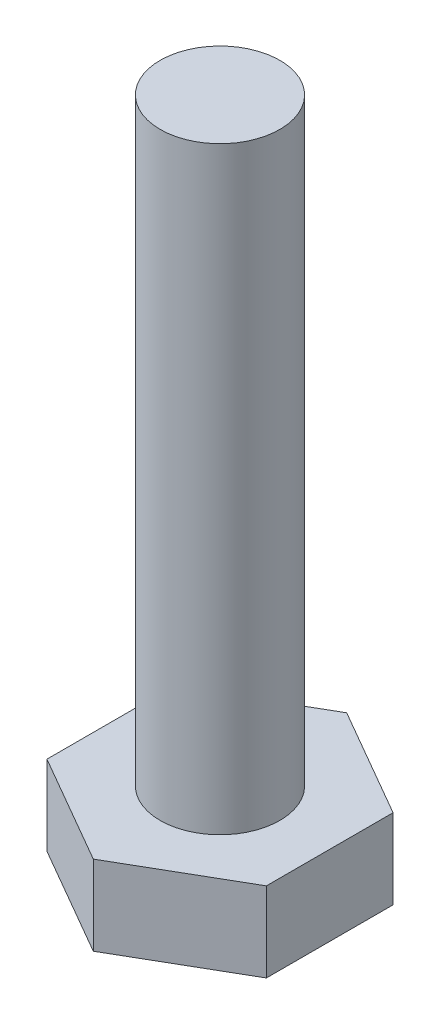
ISO-10303-21;
HEADER;
FILE_DESCRIPTION(('STEP AP214'),'2;1');
FILE_NAME('part.step','',(''),(''),'','','');
FILE_SCHEMA(('AUTOMOTIVE_DESIGN { 1 0 10303 214 1 1 1 1 }'));
ENDSEC;
DATA;
#1=APPLICATION_CONTEXT('core data for automotive mechanical design processes');
#2=APPLICATION_PROTOCOL_DEFINITION('international standard','automotive_design',2000,#1);
#3=PRODUCT_CONTEXT('',#1,'mechanical');
#4=PRODUCT('Part','Part','',(#3));
#5=PRODUCT_RELATED_PRODUCT_CATEGORY('part','',(#4));
#6=PRODUCT_DEFINITION_FORMATION('','',#4);
#7=PRODUCT_DEFINITION_CONTEXT('part definition',#1,'design');
#8=PRODUCT_DEFINITION('design','',#6,#7);
#9=PRODUCT_DEFINITION_SHAPE('','',#8);
#10=(LENGTH_UNIT() NAMED_UNIT(*) SI_UNIT(.MILLI.,.METRE.));
#11=(NAMED_UNIT(*) PLANE_ANGLE_UNIT() SI_UNIT($,.RADIAN.));
#12=(NAMED_UNIT(*) SI_UNIT($,.STERADIAN.) SOLID_ANGLE_UNIT());
#13=UNCERTAINTY_MEASURE_WITH_UNIT(LENGTH_MEASURE(1.E-05),#10,'distance_accuracy_value','');
#14=(GEOMETRIC_REPRESENTATION_CONTEXT(3) GLOBAL_UNCERTAINTY_ASSIGNED_CONTEXT((#13)) GLOBAL_UNIT_ASSIGNED_CONTEXT((#10,
#11,#12)) REPRESENTATION_CONTEXT('',''));
#15=CARTESIAN_POINT('',(0.,0.,0.));
#16=DIRECTION('',(0.,0.,1.));
#17=DIRECTION('',(1.,0.,0.));
#18=AXIS2_PLACEMENT_3D('',#15,#16,#17);
#19=CARTESIAN_POINT('',(2.74999999999998,2.,-1.5877132402715));
#20=DIRECTION('',(-0.499999999999995,0.,0.866025403784442));
#21=DIRECTION('',(0.866025403784442,0.,0.499999999999995));
#22=AXIS2_PLACEMENT_3D('',#19,#20,#21);
#23=PLANE('',#22);
#24=DIRECTION('',(-0.866025403784442,0.,-0.499999999999995));
#25=VECTOR('',#24,1.);
#26=CARTESIAN_POINT('',(2.74999999999998,0.,-1.5877132402715));
#27=LINE('',#26,#25);
#28=CARTESIAN_POINT('',(2.74999999999998,0.,-1.5877132402715));
#29=VERTEX_POINT('',#28);
#30=CARTESIAN_POINT('',(0.,0.,-3.17542648054294));
#31=VERTEX_POINT('',#30);
#32=EDGE_CURVE('E118',#29,#31,#27,.T.);
#33=ORIENTED_EDGE('',*,*,#32,.T.);
#34=DIRECTION('',(0.,-1.,0.));
#35=VECTOR('',#34,1.);
#36=CARTESIAN_POINT('',(0.,2.,-3.17542648054294));
#37=LINE('',#36,#35);
#38=CARTESIAN_POINT('',(0.,2.,-3.17542648054294));
#39=VERTEX_POINT('',#38);
#40=EDGE_CURVE('E11',#39,#31,#37,.T.);
#41=ORIENTED_EDGE('',*,*,#40,.F.);
#42=DIRECTION('',(-0.866025403784442,0.,-0.499999999999995));
#43=VECTOR('',#42,1.);
#44=CARTESIAN_POINT('',(2.74999999999998,2.,-1.5877132402715));
#45=LINE('',#44,#43);
#46=CARTESIAN_POINT('',(2.74999999999998,2.,-1.5877132402715));
#47=VERTEX_POINT('',#46);
#48=EDGE_CURVE('E129',#47,#39,#45,.T.);
#49=ORIENTED_EDGE('',*,*,#48,.F.);
#50=DIRECTION('',(0.,-1.,0.));
#51=VECTOR('',#50,1.);
#52=CARTESIAN_POINT('',(2.74999999999998,2.,-1.5877132402715));
#53=LINE('',#52,#51);
#54=EDGE_CURVE('E114',#47,#29,#53,.T.);
#55=ORIENTED_EDGE('',*,*,#54,.T.);
#56=EDGE_LOOP('',(#33,#41,#49,#55));
#57=FACE_BOUND('',#56,.T.);
#58=ADVANCED_FACE('F34',(#57),#23,.F.);
#59=CARTESIAN_POINT('',(0.,2.,-3.17542648054294));
#60=DIRECTION('',(0.500000000000001,0.,0.866025403784438));
#61=DIRECTION('',(0.866025403784438,0.,-0.500000000000001));
#62=AXIS2_PLACEMENT_3D('',#59,#60,#61);
#63=PLANE('',#62);
#64=DIRECTION('',(-0.866025403784438,0.,0.500000000000001));
#65=VECTOR('',#64,1.);
#66=CARTESIAN_POINT('',(0.,0.,-3.17542648054294));
#67=LINE('',#66,#65);
#68=CARTESIAN_POINT('',(-2.75000000000001,0.,-1.58771324027147));
#69=VERTEX_POINT('',#68);
#70=EDGE_CURVE('E121',#31,#69,#67,.T.);
#71=ORIENTED_EDGE('',*,*,#70,.T.);
#72=DIRECTION('',(0.,-1.,0.));
#73=VECTOR('',#72,1.);
#74=CARTESIAN_POINT('',(-2.75000000000001,2.,-1.58771324027147));
#75=LINE('',#74,#73);
#76=CARTESIAN_POINT('',(-2.75000000000001,2.,-1.58771324027147));
#77=VERTEX_POINT('',#76);
#78=EDGE_CURVE('E42',#77,#69,#75,.T.);
#79=ORIENTED_EDGE('',*,*,#78,.F.);
#80=DIRECTION('',(-0.866025403784438,0.,0.500000000000001));
#81=VECTOR('',#80,1.);
#82=CARTESIAN_POINT('',(0.,2.,-3.17542648054294));
#83=LINE('',#82,#81);
#84=EDGE_CURVE('E87',#39,#77,#83,.T.);
#85=ORIENTED_EDGE('',*,*,#84,.F.);
#86=ORIENTED_EDGE('',*,*,#40,.T.);
#87=EDGE_LOOP('',(#71,#79,#85,#86));
#88=FACE_BOUND('',#87,.T.);
#89=ADVANCED_FACE('F154',(#88),#63,.F.);
#90=CARTESIAN_POINT('',(-2.75000000000001,2.,-1.58771324027147));
#91=DIRECTION('',(1.,0.,0.));
#92=DIRECTION('',(0.,0.,-1.));
#93=AXIS2_PLACEMENT_3D('',#90,#91,#92);
#94=PLANE('',#93);
#95=DIRECTION('',(0.,0.,1.));
#96=VECTOR('',#95,1.);
#97=CARTESIAN_POINT('',(-2.75000000000001,0.,-1.58771324027147));
#98=LINE('',#97,#96);
#99=CARTESIAN_POINT('',(-2.74999999999999,0.,1.58771324027148));
#100=VERTEX_POINT('',#99);
#101=EDGE_CURVE('E124',#69,#100,#98,.T.);
#102=ORIENTED_EDGE('',*,*,#101,.T.);
#103=DIRECTION('',(0.,-1.,0.));
#104=VECTOR('',#103,1.);
#105=CARTESIAN_POINT('',(-2.74999999999999,2.,1.58771324027148));
#106=LINE('',#105,#104);
#107=CARTESIAN_POINT('',(-2.74999999999999,2.,1.58771324027148));
#108=VERTEX_POINT('',#107);
#109=EDGE_CURVE('E109',#108,#100,#106,.T.);
#110=ORIENTED_EDGE('',*,*,#109,.F.);
#111=DIRECTION('',(0.,0.,1.));
#112=VECTOR('',#111,1.);
#113=CARTESIAN_POINT('',(-2.75000000000001,2.,-1.58771324027147));
#114=LINE('',#113,#112);
#115=EDGE_CURVE('E100',#77,#108,#114,.T.);
#116=ORIENTED_EDGE('',*,*,#115,.F.);
#117=ORIENTED_EDGE('',*,*,#78,.T.);
#118=EDGE_LOOP('',(#102,#110,#116,#117));
#119=FACE_BOUND('',#118,.T.);
#120=ADVANCED_FACE('F135',(#119),#94,.F.);
#121=CARTESIAN_POINT('',(-2.74999999999999,2.,1.58771324027148));
#122=DIRECTION('',(0.499999999999995,0.,-0.866025403784441));
#123=DIRECTION('',(-0.866025403784442,0.,-0.499999999999995));
#124=AXIS2_PLACEMENT_3D('',#121,#122,#123);
#125=PLANE('',#124);
#126=DIRECTION('',(0.866025403784441,0.,0.499999999999995));
#127=VECTOR('',#126,1.);
#128=CARTESIAN_POINT('',(-2.74999999999999,0.,1.58771324027148));
#129=LINE('',#128,#127);
#130=CARTESIAN_POINT('',(0.,0.,3.17542648054294));
#131=VERTEX_POINT('',#130);
#132=EDGE_CURVE('E108',#100,#131,#129,.T.);
#133=ORIENTED_EDGE('',*,*,#132,.T.);
#134=DIRECTION('',(0.,-1.,0.));
#135=VECTOR('',#134,1.);
#136=CARTESIAN_POINT('',(0.,2.,3.17542648054294));
#137=LINE('',#136,#135);
#138=CARTESIAN_POINT('',(0.,2.,3.17542648054294));
#139=VERTEX_POINT('',#138);
#140=EDGE_CURVE('E105',#139,#131,#137,.T.);
#141=ORIENTED_EDGE('',*,*,#140,.F.);
#142=DIRECTION('',(0.866025403784441,0.,0.499999999999995));
#143=VECTOR('',#142,1.);
#144=CARTESIAN_POINT('',(-2.74999999999999,2.,1.58771324027148));
#145=LINE('',#144,#143);
#146=EDGE_CURVE('E94',#108,#139,#145,.T.);
#147=ORIENTED_EDGE('',*,*,#146,.F.);
#148=ORIENTED_EDGE('',*,*,#109,.T.);
#149=EDGE_LOOP('',(#133,#141,#147,#148));
#150=FACE_BOUND('',#149,.T.);
#151=ADVANCED_FACE('F106',(#150),#125,.F.);
#152=CARTESIAN_POINT('',(0.,2.,3.17542648054294));
#153=DIRECTION('',(-0.500000000000007,0.,-0.866025403784435));
#154=DIRECTION('',(-0.866025403784435,0.,0.500000000000007));
#155=AXIS2_PLACEMENT_3D('',#152,#153,#154);
#156=PLANE('',#155);
#157=DIRECTION('',(0.866025403784435,0.,-0.500000000000007));
#158=VECTOR('',#157,1.);
#159=CARTESIAN_POINT('',(0.,0.,3.17542648054294));
#160=LINE('',#159,#158);
#161=CARTESIAN_POINT('',(2.75000000000002,0.,1.58771324027145));
#162=VERTEX_POINT('',#161);
#163=EDGE_CURVE('E73',#131,#162,#160,.T.);
#164=ORIENTED_EDGE('',*,*,#163,.T.);
#165=DIRECTION('',(0.,-1.,0.));
#166=VECTOR('',#165,1.);
#167=CARTESIAN_POINT('',(2.75000000000002,2.,1.58771324027145));
#168=LINE('',#167,#166);
#169=CARTESIAN_POINT('',(2.75000000000002,2.,1.58771324027145));
#170=VERTEX_POINT('',#169);
#171=EDGE_CURVE('E110',#170,#162,#168,.T.);
#172=ORIENTED_EDGE('',*,*,#171,.F.);
#173=DIRECTION('',(0.866025403784435,0.,-0.500000000000007));
#174=VECTOR('',#173,1.);
#175=CARTESIAN_POINT('',(0.,2.,3.17542648054294));
#176=LINE('',#175,#174);
#177=EDGE_CURVE('E98',#139,#170,#176,.T.);
#178=ORIENTED_EDGE('',*,*,#177,.F.);
#179=ORIENTED_EDGE('',*,*,#140,.T.);
#180=EDGE_LOOP('',(#164,#172,#178,#179));
#181=FACE_BOUND('',#180,.T.);
#182=ADVANCED_FACE('F112',(#181),#156,.F.);
#183=CARTESIAN_POINT('',(2.75000000000002,2.,1.58771324027145));
#184=DIRECTION('',(-1.,0.,0.));
#185=DIRECTION('',(0.,0.,1.));
#186=AXIS2_PLACEMENT_3D('',#183,#184,#185);
#187=PLANE('',#186);
#188=DIRECTION('',(0.,0.,-1.));
#189=VECTOR('',#188,1.);
#190=CARTESIAN_POINT('',(2.75000000000002,0.,1.58771324027145));
#191=LINE('',#190,#189);
#192=EDGE_CURVE('E79',#162,#29,#191,.T.);
#193=ORIENTED_EDGE('',*,*,#192,.T.);
#194=ORIENTED_EDGE('',*,*,#54,.F.);
#195=DIRECTION('',(0.,0.,-1.));
#196=VECTOR('',#195,1.);
#197=CARTESIAN_POINT('',(2.75000000000002,2.,1.58771324027145));
#198=LINE('',#197,#196);
#199=EDGE_CURVE('E50',#170,#47,#198,.T.);
#200=ORIENTED_EDGE('',*,*,#199,.F.);
#201=ORIENTED_EDGE('',*,*,#171,.T.);
#202=EDGE_LOOP('',(#193,#194,#200,#201));
#203=FACE_BOUND('',#202,.T.);
#204=ADVANCED_FACE('F142',(#203),#187,.F.);
#205=CARTESIAN_POINT('',(0.,2.,0.));
#206=DIRECTION('',(0.,1.,0.));
#207=DIRECTION('',(0.,0.,1.));
#208=AXIS2_PLACEMENT_3D('',#205,#206,#207);
#209=PLANE('',#208);
#210=CARTESIAN_POINT('',(0.,2.,0.));
#211=DIRECTION('',(0.,1.,0.));
#212=DIRECTION('',(0.,0.,1.));
#213=AXIS2_PLACEMENT_3D('',#210,#211,#212);
#214=CIRCLE('',#213,1.5);
#215=CARTESIAN_POINT('',(0.,2.,1.5));
#216=VERTEX_POINT('',#215);
#217=EDGE_CURVE('E215',#216,#216,#214,.T.);
#218=ORIENTED_EDGE('',*,*,#217,.F.);
#219=EDGE_LOOP('',(#218));
#220=FACE_BOUND('',#219,.T.);
#221=ORIENTED_EDGE('',*,*,#48,.T.);
#222=ORIENTED_EDGE('',*,*,#84,.T.);
#223=ORIENTED_EDGE('',*,*,#115,.T.);
#224=ORIENTED_EDGE('',*,*,#146,.T.);
#225=ORIENTED_EDGE('',*,*,#177,.T.);
#226=ORIENTED_EDGE('',*,*,#199,.T.);
#227=EDGE_LOOP('',(#221,#222,#223,#224,#225,#226));
#228=FACE_BOUND('',#227,.T.);
#229=ADVANCED_FACE('F96',(#220,#228),#209,.T.);
#230=CARTESIAN_POINT('',(0.,0.,0.));
#231=DIRECTION('',(0.,1.,0.));
#232=DIRECTION('',(0.,0.,1.));
#233=AXIS2_PLACEMENT_3D('',#230,#231,#232);
#234=PLANE('',#233);
#235=ORIENTED_EDGE('',*,*,#32,.F.);
#236=ORIENTED_EDGE('',*,*,#192,.F.);
#237=ORIENTED_EDGE('',*,*,#163,.F.);
#238=ORIENTED_EDGE('',*,*,#132,.F.);
#239=ORIENTED_EDGE('',*,*,#101,.F.);
#240=ORIENTED_EDGE('',*,*,#70,.F.);
#241=EDGE_LOOP('',(#235,#236,#237,#238,#239,#240));
#242=FACE_BOUND('',#241,.T.);
#243=ADVANCED_FACE('F138',(#242),#234,.F.);
#244=CARTESIAN_POINT('',(0.,17.,0.));
#245=DIRECTION('',(0.,-1.,0.));
#246=DIRECTION('',(0.,0.,-1.));
#247=AXIS2_PLACEMENT_3D('',#244,#245,#246);
#248=CYLINDRICAL_SURFACE('',#247,1.5);
#249=CARTESIAN_POINT('',(0.,17.,0.));
#250=DIRECTION('',(0.,1.,0.));
#251=DIRECTION('',(0.,0.,1.));
#252=AXIS2_PLACEMENT_3D('',#249,#250,#251);
#253=CIRCLE('',#252,1.5);
#254=CARTESIAN_POINT('',(0.,17.,1.5));
#255=VERTEX_POINT('',#254);
#256=EDGE_CURVE('E122',#255,#255,#253,.T.);
#257=ORIENTED_EDGE('',*,*,#256,.F.);
#258=EDGE_LOOP('',(#257));
#259=FACE_BOUND('',#258,.T.);
#260=ORIENTED_EDGE('',*,*,#217,.T.);
#261=EDGE_LOOP('',(#260));
#262=FACE_BOUND('',#261,.T.);
#263=ADVANCED_FACE('F186',(#259,#262),#248,.T.);
#264=CARTESIAN_POINT('',(0.,17.,0.));
#265=DIRECTION('',(0.,1.,0.));
#266=DIRECTION('',(0.,0.,1.));
#267=AXIS2_PLACEMENT_3D('',#264,#265,#266);
#268=PLANE('',#267);
#269=ORIENTED_EDGE('',*,*,#256,.T.);
#270=EDGE_LOOP('',(#269));
#271=FACE_BOUND('',#270,.T.);
#272=ADVANCED_FACE('F199',(#271),#268,.T.);
#273=CLOSED_SHELL('',(#58,#89,#120,#151,#182,#204,#229,#243,#263,#272));
#274=MANIFOLD_SOLID_BREP('B2',#273);
#275=ADVANCED_BREP_SHAPE_REPRESENTATION('',(#18,#274),#14);
#276=SHAPE_DEFINITION_REPRESENTATION(#9,#275);
ENDSEC;
END-ISO-10303-21;
